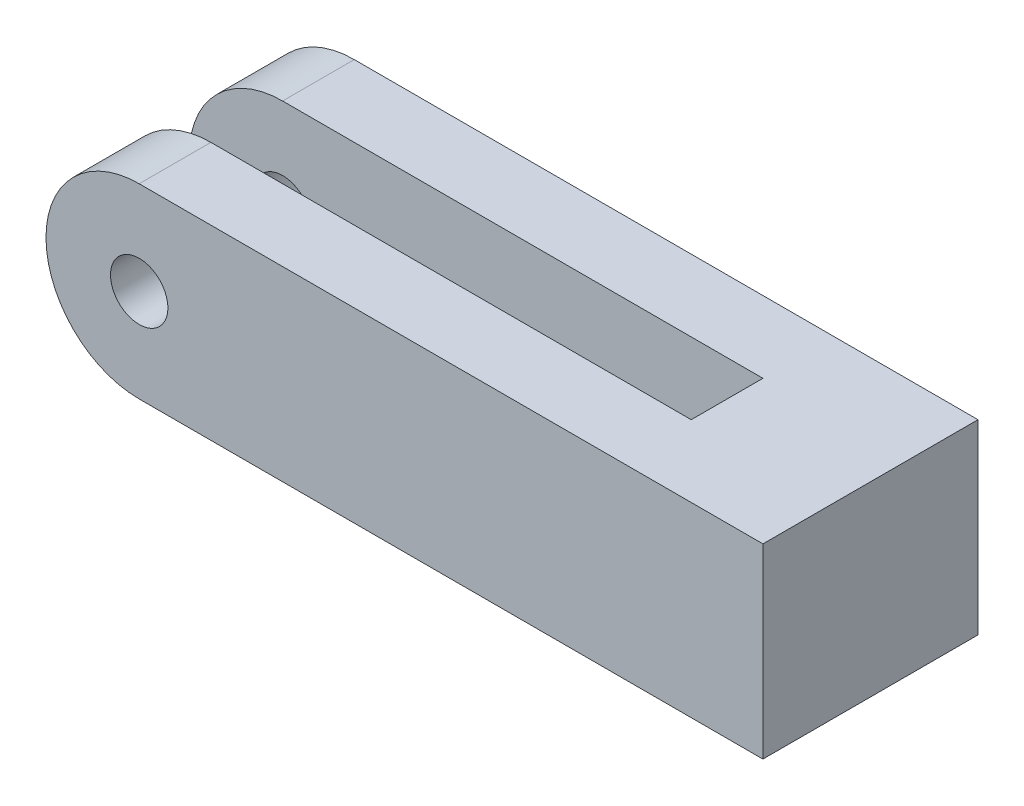
ISO-10303-21;
HEADER;
FILE_DESCRIPTION(('STEP AP214'),'2;1');
FILE_NAME('part.step','',(''),(''),'','','');
FILE_SCHEMA(('AUTOMOTIVE_DESIGN { 1 0 10303 214 1 1 1 1 }'));
ENDSEC;
DATA;
#1=APPLICATION_CONTEXT('core data for automotive mechanical design processes');
#2=APPLICATION_PROTOCOL_DEFINITION('international standard','automotive_design',2000,#1);
#3=PRODUCT_CONTEXT('',#1,'mechanical');
#4=PRODUCT('Part','Part','',(#3));
#5=PRODUCT_RELATED_PRODUCT_CATEGORY('part','',(#4));
#6=PRODUCT_DEFINITION_FORMATION('','',#4);
#7=PRODUCT_DEFINITION_CONTEXT('part definition',#1,'design');
#8=PRODUCT_DEFINITION('design','',#6,#7);
#9=PRODUCT_DEFINITION_SHAPE('','',#8);
#10=(LENGTH_UNIT() NAMED_UNIT(*) SI_UNIT(.MILLI.,.METRE.));
#11=(NAMED_UNIT(*) PLANE_ANGLE_UNIT() SI_UNIT($,.RADIAN.));
#12=(NAMED_UNIT(*) SI_UNIT($,.STERADIAN.) SOLID_ANGLE_UNIT());
#13=UNCERTAINTY_MEASURE_WITH_UNIT(LENGTH_MEASURE(1.E-05),#10,'distance_accuracy_value','');
#14=(GEOMETRIC_REPRESENTATION_CONTEXT(3) GLOBAL_UNCERTAINTY_ASSIGNED_CONTEXT((#13)) GLOBAL_UNIT_ASSIGNED_CONTEXT((#10,
#11,#12)) REPRESENTATION_CONTEXT('',''));
#15=CARTESIAN_POINT('',(0.,0.,0.));
#16=DIRECTION('',(0.,0.,1.));
#17=DIRECTION('',(1.,0.,0.));
#18=AXIS2_PLACEMENT_3D('',#15,#16,#17);
#19=CARTESIAN_POINT('',(-60.,13.,15.));
#20=DIRECTION('',(0.,-1.,0.));
#21=DIRECTION('',(0.,0.,-1.));
#22=AXIS2_PLACEMENT_3D('',#19,#20,#21);
#23=PLANE('',#22);
#24=DIRECTION('',(0.,0.,1.));
#25=VECTOR('',#24,1.);
#26=CARTESIAN_POINT('',(40.,13.,-149.259817638368));
#27=LINE('',#26,#25);
#28=CARTESIAN_POINT('',(40.,13.,-5.));
#29=VERTEX_POINT('',#28);
#30=CARTESIAN_POINT('',(40.,13.,5.));
#31=VERTEX_POINT('',#30);
#32=EDGE_CURVE('E51',#29,#31,#27,.T.);
#33=ORIENTED_EDGE('',*,*,#32,.T.);
#34=DIRECTION('',(-1.,0.,0.));
#35=VECTOR('',#34,1.);
#36=CARTESIAN_POINT('',(-60.,13.,5.));
#37=LINE('',#36,#35);
#38=CARTESIAN_POINT('',(-27.,13.,5.));
#39=VERTEX_POINT('',#38);
#40=EDGE_CURVE('E152',#31,#39,#37,.T.);
#41=ORIENTED_EDGE('',*,*,#40,.T.);
#42=DIRECTION('',(0.,0.,1.));
#43=VECTOR('',#42,1.);
#44=CARTESIAN_POINT('',(-27.,13.,-154.621513703624));
#45=LINE('',#44,#43);
#46=CARTESIAN_POINT('',(-27.,13.,15.));
#47=VERTEX_POINT('',#46);
#48=EDGE_CURVE('E155',#39,#47,#45,.T.);
#49=ORIENTED_EDGE('',*,*,#48,.T.);
#50=DIRECTION('',(-1.,0.,0.));
#51=VECTOR('',#50,1.);
#52=CARTESIAN_POINT('',(-60.,13.,15.));
#53=LINE('',#52,#51);
#54=CARTESIAN_POINT('',(60.,13.,15.));
#55=VERTEX_POINT('',#54);
#56=EDGE_CURVE('E164',#55,#47,#53,.T.);
#57=ORIENTED_EDGE('',*,*,#56,.F.);
#58=DIRECTION('',(0.,0.,-1.));
#59=VECTOR('',#58,1.);
#60=CARTESIAN_POINT('',(60.,13.,15.));
#61=LINE('',#60,#59);
#62=CARTESIAN_POINT('',(60.,13.,-15.));
#63=VERTEX_POINT('',#62);
#64=EDGE_CURVE('E11',#55,#63,#61,.T.);
#65=ORIENTED_EDGE('',*,*,#64,.T.);
#66=DIRECTION('',(-1.,0.,0.));
#67=VECTOR('',#66,1.);
#68=CARTESIAN_POINT('',(-60.,13.,-15.));
#69=LINE('',#68,#67);
#70=CARTESIAN_POINT('',(-27.,13.,-15.));
#71=VERTEX_POINT('',#70);
#72=EDGE_CURVE('E123',#63,#71,#69,.T.);
#73=ORIENTED_EDGE('',*,*,#72,.T.);
#74=DIRECTION('',(0.,0.,-1.));
#75=VECTOR('',#74,1.);
#76=CARTESIAN_POINT('',(-27.,13.,154.621513703624));
#77=LINE('',#76,#75);
#78=CARTESIAN_POINT('',(-27.,13.,-5.));
#79=VERTEX_POINT('',#78);
#80=EDGE_CURVE('E106',#79,#71,#77,.T.);
#81=ORIENTED_EDGE('',*,*,#80,.F.);
#82=DIRECTION('',(-1.,0.,0.));
#83=VECTOR('',#82,1.);
#84=CARTESIAN_POINT('',(-60.,13.,-5.));
#85=LINE('',#84,#83);
#86=EDGE_CURVE('E113',#29,#79,#85,.T.);
#87=ORIENTED_EDGE('',*,*,#86,.F.);
#88=EDGE_LOOP('',(#33,#41,#49,#57,#65,#73,#81,#87));
#89=FACE_BOUND('',#88,.T.);
#90=ADVANCED_FACE('F35',(#89),#23,.F.);
#91=CARTESIAN_POINT('',(-60.,-13.,15.));
#92=DIRECTION('',(0.,1.,0.));
#93=DIRECTION('',(0.,0.,1.));
#94=AXIS2_PLACEMENT_3D('',#91,#92,#93);
#95=PLANE('',#94);
#96=DIRECTION('',(0.,0.,1.));
#97=VECTOR('',#96,1.);
#98=CARTESIAN_POINT('',(40.,-13.,-149.259817638368));
#99=LINE('',#98,#97);
#100=CARTESIAN_POINT('',(40.,-13.,-5.));
#101=VERTEX_POINT('',#100);
#102=CARTESIAN_POINT('',(40.,-13.,5.));
#103=VERTEX_POINT('',#102);
#104=EDGE_CURVE('E145',#101,#103,#99,.T.);
#105=ORIENTED_EDGE('',*,*,#104,.F.);
#106=DIRECTION('',(1.,0.,0.));
#107=VECTOR('',#106,1.);
#108=CARTESIAN_POINT('',(-60.,-13.,-5.));
#109=LINE('',#108,#107);
#110=CARTESIAN_POINT('',(-27.,-13.,-5.));
#111=VERTEX_POINT('',#110);
#112=EDGE_CURVE('E120',#111,#101,#109,.T.);
#113=ORIENTED_EDGE('',*,*,#112,.F.);
#114=DIRECTION('',(0.,0.,-1.));
#115=VECTOR('',#114,1.);
#116=CARTESIAN_POINT('',(-27.,-13.,154.621513703624));
#117=LINE('',#116,#115);
#118=CARTESIAN_POINT('',(-27.,-13.,-15.));
#119=VERTEX_POINT('',#118);
#120=EDGE_CURVE('E109',#111,#119,#117,.T.);
#121=ORIENTED_EDGE('',*,*,#120,.T.);
#122=DIRECTION('',(1.,0.,0.));
#123=VECTOR('',#122,1.);
#124=CARTESIAN_POINT('',(-60.,-13.,-15.));
#125=LINE('',#124,#123);
#126=CARTESIAN_POINT('',(60.,-13.,-15.));
#127=VERTEX_POINT('',#126);
#128=EDGE_CURVE('E134',#119,#127,#125,.T.);
#129=ORIENTED_EDGE('',*,*,#128,.T.);
#130=DIRECTION('',(0.,0.,-1.));
#131=VECTOR('',#130,1.);
#132=CARTESIAN_POINT('',(60.,-13.,15.));
#133=LINE('',#132,#131);
#134=CARTESIAN_POINT('',(60.,-13.,15.));
#135=VERTEX_POINT('',#134);
#136=EDGE_CURVE('E44',#135,#127,#133,.T.);
#137=ORIENTED_EDGE('',*,*,#136,.F.);
#138=DIRECTION('',(1.,0.,0.));
#139=VECTOR('',#138,1.);
#140=CARTESIAN_POINT('',(-60.,-13.,15.));
#141=LINE('',#140,#139);
#142=CARTESIAN_POINT('',(-27.,-13.,15.));
#143=VERTEX_POINT('',#142);
#144=EDGE_CURVE('E167',#143,#135,#141,.T.);
#145=ORIENTED_EDGE('',*,*,#144,.F.);
#146=DIRECTION('',(0.,0.,1.));
#147=VECTOR('',#146,1.);
#148=CARTESIAN_POINT('',(-27.,-13.,-154.621513703624));
#149=LINE('',#148,#147);
#150=CARTESIAN_POINT('',(-27.,-13.,5.));
#151=VERTEX_POINT('',#150);
#152=EDGE_CURVE('E149',#151,#143,#149,.T.);
#153=ORIENTED_EDGE('',*,*,#152,.F.);
#154=DIRECTION('',(1.,0.,0.));
#155=VECTOR('',#154,1.);
#156=CARTESIAN_POINT('',(-60.,-13.,5.));
#157=LINE('',#156,#155);
#158=EDGE_CURVE('E59',#151,#103,#157,.T.);
#159=ORIENTED_EDGE('',*,*,#158,.T.);
#160=EDGE_LOOP('',(#105,#113,#121,#129,#137,#145,#153,#159));
#161=FACE_BOUND('',#160,.T.);
#162=ADVANCED_FACE('F178',(#161),#95,.F.);
#163=CARTESIAN_POINT('',(-27.,0.,-154.621513703624));
#164=DIRECTION('',(0.,0.,1.));
#165=DIRECTION('',(1.,0.,0.));
#166=AXIS2_PLACEMENT_3D('',#163,#164,#165);
#167=CYLINDRICAL_SURFACE('',#166,13.);
#168=CARTESIAN_POINT('',(-27.,0.,5.));
#169=DIRECTION('',(0.,0.,-1.));
#170=DIRECTION('',(-1.,0.,0.));
#171=AXIS2_PLACEMENT_3D('',#168,#169,#170);
#172=CIRCLE('',#171,13.);
#173=EDGE_CURVE('E150',#39,#151,#172,.F.);
#174=ORIENTED_EDGE('',*,*,#173,.T.);
#175=ORIENTED_EDGE('',*,*,#152,.T.);
#176=CARTESIAN_POINT('',(-27.,0.,15.));
#177=DIRECTION('',(0.,0.,-1.));
#178=DIRECTION('',(-1.,0.,0.));
#179=AXIS2_PLACEMENT_3D('',#176,#177,#178);
#180=CIRCLE('',#179,13.);
#181=EDGE_CURVE('E157',#47,#143,#180,.F.);
#182=ORIENTED_EDGE('',*,*,#181,.F.);
#183=ORIENTED_EDGE('',*,*,#48,.F.);
#184=EDGE_LOOP('',(#174,#175,#182,#183));
#185=FACE_BOUND('',#184,.T.);
#186=ADVANCED_FACE('F202',(#185),#167,.T.);
#187=CARTESIAN_POINT('',(60.,-13.,15.));
#188=DIRECTION('',(-1.,0.,0.));
#189=DIRECTION('',(0.,0.,1.));
#190=AXIS2_PLACEMENT_3D('',#187,#188,#189);
#191=PLANE('',#190);
#192=ORIENTED_EDGE('',*,*,#136,.T.);
#193=DIRECTION('',(0.,1.,0.));
#194=VECTOR('',#193,1.);
#195=CARTESIAN_POINT('',(60.,-13.,-15.));
#196=LINE('',#195,#194);
#197=EDGE_CURVE('E126',#127,#63,#196,.T.);
#198=ORIENTED_EDGE('',*,*,#197,.T.);
#199=ORIENTED_EDGE('',*,*,#64,.F.);
#200=DIRECTION('',(0.,1.,0.));
#201=VECTOR('',#200,1.);
#202=CARTESIAN_POINT('',(60.,-13.,15.));
#203=LINE('',#202,#201);
#204=EDGE_CURVE('E161',#135,#55,#203,.T.);
#205=ORIENTED_EDGE('',*,*,#204,.F.);
#206=EDGE_LOOP('',(#192,#198,#199,#205));
#207=FACE_BOUND('',#206,.T.);
#208=ADVANCED_FACE('F37',(#207),#191,.F.);
#209=CARTESIAN_POINT('',(0.,0.,15.));
#210=DIRECTION('',(0.,0.,-1.));
#211=DIRECTION('',(-1.,0.,0.));
#212=AXIS2_PLACEMENT_3D('',#209,#210,#211);
#213=PLANE('',#212);
#214=CARTESIAN_POINT('',(-27.,0.,15.));
#215=DIRECTION('',(0.,0.,-1.));
#216=DIRECTION('',(-1.,0.,0.));
#217=AXIS2_PLACEMENT_3D('',#214,#215,#216);
#218=CIRCLE('',#217,4.);
#219=CARTESIAN_POINT('',(-31.,0.,15.));
#220=VERTEX_POINT('',#219);
#221=EDGE_CURVE('E137',#220,#220,#218,.T.);
#222=ORIENTED_EDGE('',*,*,#221,.T.);
#223=EDGE_LOOP('',(#222));
#224=FACE_BOUND('',#223,.T.);
#225=ORIENTED_EDGE('',*,*,#56,.T.);
#226=ORIENTED_EDGE('',*,*,#181,.T.);
#227=ORIENTED_EDGE('',*,*,#144,.T.);
#228=ORIENTED_EDGE('',*,*,#204,.T.);
#229=EDGE_LOOP('',(#225,#226,#227,#228));
#230=FACE_BOUND('',#229,.T.);
#231=ADVANCED_FACE('F205',(#224,#230),#213,.F.);
#232=CARTESIAN_POINT('',(40.,13.,-149.259817638368));
#233=DIRECTION('',(-1.,0.,0.));
#234=DIRECTION('',(0.,0.,1.));
#235=AXIS2_PLACEMENT_3D('',#232,#233,#234);
#236=PLANE('',#235);
#237=ORIENTED_EDGE('',*,*,#32,.F.);
#238=DIRECTION('',(0.,-1.,0.));
#239=VECTOR('',#238,1.);
#240=CARTESIAN_POINT('',(40.,13.,-5.));
#241=LINE('',#240,#239);
#242=EDGE_CURVE('E119',#29,#101,#241,.T.);
#243=ORIENTED_EDGE('',*,*,#242,.T.);
#244=ORIENTED_EDGE('',*,*,#104,.T.);
#245=DIRECTION('',(0.,-1.,0.));
#246=VECTOR('',#245,1.);
#247=CARTESIAN_POINT('',(40.,13.,5.));
#248=LINE('',#247,#246);
#249=EDGE_CURVE('E143',#31,#103,#248,.T.);
#250=ORIENTED_EDGE('',*,*,#249,.F.);
#251=EDGE_LOOP('',(#237,#243,#244,#250));
#252=FACE_BOUND('',#251,.T.);
#253=ADVANCED_FACE('F208',(#252),#236,.T.);
#254=CARTESIAN_POINT('',(0.,0.,5.));
#255=DIRECTION('',(0.,0.,-1.));
#256=DIRECTION('',(-1.,0.,0.));
#257=AXIS2_PLACEMENT_3D('',#254,#255,#256);
#258=PLANE('',#257);
#259=CARTESIAN_POINT('',(-27.,0.,5.));
#260=DIRECTION('',(0.,0.,-1.));
#261=DIRECTION('',(-1.,0.,0.));
#262=AXIS2_PLACEMENT_3D('',#259,#260,#261);
#263=CIRCLE('',#262,4.);
#264=CARTESIAN_POINT('',(-31.,0.,5.));
#265=VERTEX_POINT('',#264);
#266=EDGE_CURVE('E39',#265,#265,#263,.T.);
#267=ORIENTED_EDGE('',*,*,#266,.F.);
#268=EDGE_LOOP('',(#267));
#269=FACE_BOUND('',#268,.T.);
#270=ORIENTED_EDGE('',*,*,#249,.T.);
#271=ORIENTED_EDGE('',*,*,#158,.F.);
#272=ORIENTED_EDGE('',*,*,#173,.F.);
#273=ORIENTED_EDGE('',*,*,#40,.F.);
#274=EDGE_LOOP('',(#270,#271,#272,#273));
#275=FACE_BOUND('',#274,.T.);
#276=ADVANCED_FACE('F213',(#269,#275),#258,.T.);
#277=CARTESIAN_POINT('',(-27.,0.,15.));
#278=DIRECTION('',(0.,0.,-1.));
#279=DIRECTION('',(-1.,0.,0.));
#280=AXIS2_PLACEMENT_3D('',#277,#278,#279);
#281=CYLINDRICAL_SURFACE('',#280,4.);
#282=ORIENTED_EDGE('',*,*,#266,.T.);
#283=EDGE_LOOP('',(#282));
#284=FACE_BOUND('',#283,.T.);
#285=ORIENTED_EDGE('',*,*,#221,.F.);
#286=EDGE_LOOP('',(#285));
#287=FACE_BOUND('',#286,.T.);
#288=ADVANCED_FACE('F195',(#284,#287),#281,.F.);
#289=CARTESIAN_POINT('',(-27.,0.,154.621513703624));
#290=DIRECTION('',(0.,0.,-1.));
#291=DIRECTION('',(1.,0.,0.));
#292=AXIS2_PLACEMENT_3D('',#289,#290,#291);
#293=CYLINDRICAL_SURFACE('',#292,13.);
#294=CARTESIAN_POINT('',(-27.,0.,-5.));
#295=DIRECTION('',(0.,0.,-1.));
#296=DIRECTION('',(-1.,0.,0.));
#297=AXIS2_PLACEMENT_3D('',#294,#295,#296);
#298=CIRCLE('',#297,13.);
#299=EDGE_CURVE('E102',#79,#111,#298,.F.);
#300=ORIENTED_EDGE('',*,*,#299,.F.);
#301=ORIENTED_EDGE('',*,*,#80,.T.);
#302=CARTESIAN_POINT('',(-27.,0.,-15.));
#303=DIRECTION('',(0.,0.,-1.));
#304=DIRECTION('',(-1.,0.,0.));
#305=AXIS2_PLACEMENT_3D('',#302,#303,#304);
#306=CIRCLE('',#305,13.);
#307=EDGE_CURVE('E124',#71,#119,#306,.F.);
#308=ORIENTED_EDGE('',*,*,#307,.T.);
#309=ORIENTED_EDGE('',*,*,#120,.F.);
#310=EDGE_LOOP('',(#300,#301,#308,#309));
#311=FACE_BOUND('',#310,.T.);
#312=ADVANCED_FACE('F104',(#311),#293,.T.);
#313=CARTESIAN_POINT('',(0.,0.,-15.));
#314=DIRECTION('',(0.,0.,1.));
#315=DIRECTION('',(-1.,0.,0.));
#316=AXIS2_PLACEMENT_3D('',#313,#314,#315);
#317=PLANE('',#316);
#318=CARTESIAN_POINT('',(-27.,0.,-15.));
#319=DIRECTION('',(0.,0.,-1.));
#320=DIRECTION('',(-1.,0.,0.));
#321=AXIS2_PLACEMENT_3D('',#318,#319,#320);
#322=CIRCLE('',#321,4.);
#323=CARTESIAN_POINT('',(-31.,0.,-15.));
#324=VERTEX_POINT('',#323);
#325=EDGE_CURVE('E140',#324,#324,#322,.T.);
#326=ORIENTED_EDGE('',*,*,#325,.F.);
#327=EDGE_LOOP('',(#326));
#328=FACE_BOUND('',#327,.T.);
#329=ORIENTED_EDGE('',*,*,#72,.F.);
#330=ORIENTED_EDGE('',*,*,#197,.F.);
#331=ORIENTED_EDGE('',*,*,#128,.F.);
#332=ORIENTED_EDGE('',*,*,#307,.F.);
#333=EDGE_LOOP('',(#329,#330,#331,#332));
#334=FACE_BOUND('',#333,.T.);
#335=ADVANCED_FACE('F177',(#328,#334),#317,.F.);
#336=CARTESIAN_POINT('',(0.,0.,-5.));
#337=DIRECTION('',(0.,0.,1.));
#338=DIRECTION('',(-1.,0.,0.));
#339=AXIS2_PLACEMENT_3D('',#336,#337,#338);
#340=PLANE('',#339);
#341=CARTESIAN_POINT('',(-27.,0.,-5.));
#342=DIRECTION('',(0.,0.,-1.));
#343=DIRECTION('',(-1.,0.,0.));
#344=AXIS2_PLACEMENT_3D('',#341,#342,#343);
#345=CIRCLE('',#344,4.);
#346=CARTESIAN_POINT('',(-31.,0.,-5.));
#347=VERTEX_POINT('',#346);
#348=EDGE_CURVE('E114',#347,#347,#345,.T.);
#349=ORIENTED_EDGE('',*,*,#348,.T.);
#350=EDGE_LOOP('',(#349));
#351=FACE_BOUND('',#350,.T.);
#352=ORIENTED_EDGE('',*,*,#242,.F.);
#353=ORIENTED_EDGE('',*,*,#86,.T.);
#354=ORIENTED_EDGE('',*,*,#299,.T.);
#355=ORIENTED_EDGE('',*,*,#112,.T.);
#356=EDGE_LOOP('',(#352,#353,#354,#355));
#357=FACE_BOUND('',#356,.T.);
#358=ADVANCED_FACE('F117',(#351,#357),#340,.T.);
#359=CARTESIAN_POINT('',(-27.,0.,-15.));
#360=DIRECTION('',(0.,0.,1.));
#361=DIRECTION('',(-1.,0.,0.));
#362=AXIS2_PLACEMENT_3D('',#359,#360,#361);
#363=CYLINDRICAL_SURFACE('',#362,4.);
#364=ORIENTED_EDGE('',*,*,#348,.F.);
#365=EDGE_LOOP('',(#364));
#366=FACE_BOUND('',#365,.T.);
#367=ORIENTED_EDGE('',*,*,#325,.T.);
#368=EDGE_LOOP('',(#367));
#369=FACE_BOUND('',#368,.T.);
#370=ADVANCED_FACE('F185',(#366,#369),#363,.F.);
#371=CLOSED_SHELL('',(#90,#162,#186,#208,#231,#253,#276,#288,#312,#335,#358,#370));
#372=MANIFOLD_SOLID_BREP('B2',#371);
#373=ADVANCED_BREP_SHAPE_REPRESENTATION('',(#18,#372),#14);
#374=SHAPE_DEFINITION_REPRESENTATION(#9,#373);
ENDSEC;
END-ISO-10303-21;
